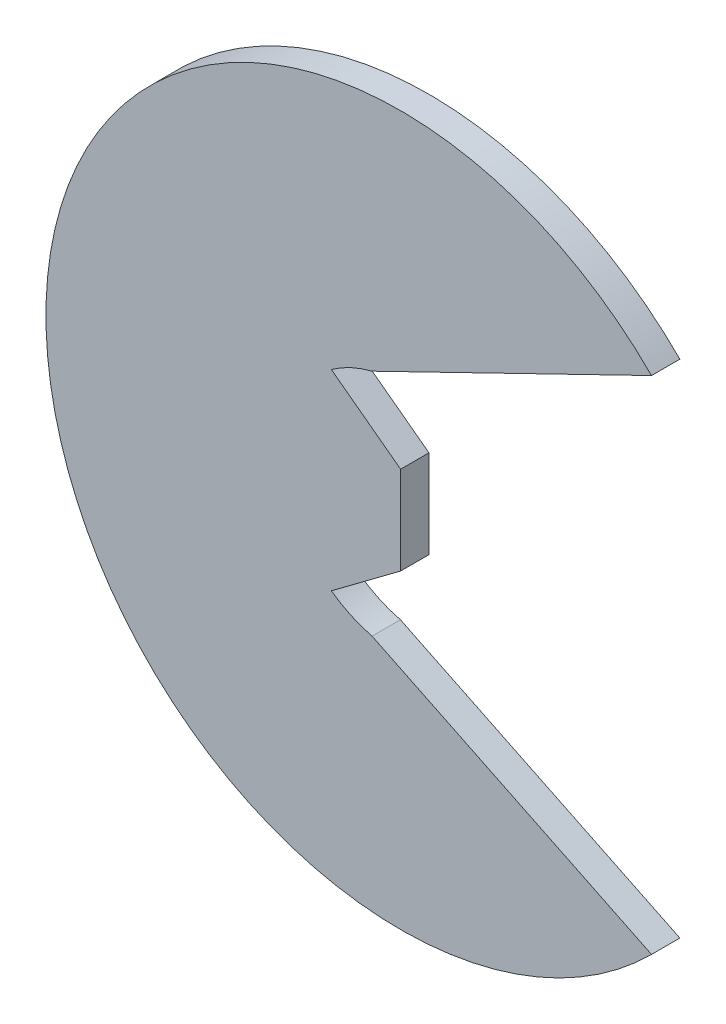
ISO-10303-21;
HEADER;
FILE_DESCRIPTION(('STEP AP214'),'2;1');
FILE_NAME('part.step','',(''),(''),'','','');
FILE_SCHEMA(('AUTOMOTIVE_DESIGN { 1 0 10303 214 1 1 1 1 }'));
ENDSEC;
DATA;
#1=APPLICATION_CONTEXT('core data for automotive mechanical design processes');
#2=APPLICATION_PROTOCOL_DEFINITION('international standard','automotive_design',2000,#1);
#3=PRODUCT_CONTEXT('',#1,'mechanical');
#4=PRODUCT('Part','Part','',(#3));
#5=PRODUCT_RELATED_PRODUCT_CATEGORY('part','',(#4));
#6=PRODUCT_DEFINITION_FORMATION('','',#4);
#7=PRODUCT_DEFINITION_CONTEXT('part definition',#1,'design');
#8=PRODUCT_DEFINITION('design','',#6,#7);
#9=PRODUCT_DEFINITION_SHAPE('','',#8);
#10=(LENGTH_UNIT() NAMED_UNIT(*) SI_UNIT(.MILLI.,.METRE.));
#11=(NAMED_UNIT(*) PLANE_ANGLE_UNIT() SI_UNIT($,.RADIAN.));
#12=(NAMED_UNIT(*) SI_UNIT($,.STERADIAN.) SOLID_ANGLE_UNIT());
#13=UNCERTAINTY_MEASURE_WITH_UNIT(LENGTH_MEASURE(1.E-05),#10,'distance_accuracy_value','');
#14=(GEOMETRIC_REPRESENTATION_CONTEXT(3) GLOBAL_UNCERTAINTY_ASSIGNED_CONTEXT((#13)) GLOBAL_UNIT_ASSIGNED_CONTEXT((#10,
#11,#12)) REPRESENTATION_CONTEXT('',''));
#15=CARTESIAN_POINT('',(0.,0.,0.));
#16=DIRECTION('',(0.,0.,1.));
#17=DIRECTION('',(1.,0.,0.));
#18=AXIS2_PLACEMENT_3D('',#15,#16,#17);
#19=CARTESIAN_POINT('',(0.,0.,0.3));
#20=DIRECTION('',(0.,0.,-1.));
#21=DIRECTION('',(-1.,0.,0.));
#22=AXIS2_PLACEMENT_3D('',#19,#20,#21);
#23=CYLINDRICAL_SURFACE('',#22,3.75);
#24=CARTESIAN_POINT('',(0.,0.,0.3));
#25=DIRECTION('',(0.,0.,1.));
#26=DIRECTION('',(1.,0.,0.));
#27=AXIS2_PLACEMENT_3D('',#24,#25,#26);
#28=CIRCLE('',#27,3.75);
#29=CARTESIAN_POINT('',(2.65301607221585,2.65028408299268,0.3));
#30=VERTEX_POINT('',#29);
#31=CARTESIAN_POINT('',(2.65301607221585,-2.65028408299268,0.3));
#32=VERTEX_POINT('',#31);
#33=EDGE_CURVE('E11',#30,#32,#28,.T.);
#34=ORIENTED_EDGE('',*,*,#33,.F.);
#35=DIRECTION('',(0.,0.,1.));
#36=VECTOR('',#35,1.);
#37=CARTESIAN_POINT('',(2.65301607221585,2.65028408299268,0.));
#38=LINE('',#37,#36);
#39=CARTESIAN_POINT('',(2.65301607221585,2.65028408299268,0.));
#40=VERTEX_POINT('',#39);
#41=EDGE_CURVE('E110',#40,#30,#38,.T.);
#42=ORIENTED_EDGE('',*,*,#41,.F.);
#43=CARTESIAN_POINT('',(0.,0.,0.));
#44=DIRECTION('',(0.,0.,1.));
#45=DIRECTION('',(1.,0.,0.));
#46=AXIS2_PLACEMENT_3D('',#43,#44,#45);
#47=CIRCLE('',#46,3.75);
#48=CARTESIAN_POINT('',(2.65301607221585,-2.65028408299268,0.));
#49=VERTEX_POINT('',#48);
#50=EDGE_CURVE('E35',#40,#49,#47,.T.);
#51=ORIENTED_EDGE('',*,*,#50,.T.);
#52=DIRECTION('',(0.,0.,1.));
#53=VECTOR('',#52,1.);
#54=CARTESIAN_POINT('',(2.65301607221585,-2.65028408299268,0.));
#55=LINE('',#54,#53);
#56=EDGE_CURVE('E100',#49,#32,#55,.T.);
#57=ORIENTED_EDGE('',*,*,#56,.T.);
#58=EDGE_LOOP('',(#34,#42,#51,#57));
#59=FACE_BOUND('',#58,.T.);
#60=ADVANCED_FACE('F32',(#59),#23,.T.);
#61=CARTESIAN_POINT('',(0.,0.,0.3));
#62=DIRECTION('',(0.,0.,1.));
#63=DIRECTION('',(1.,0.,0.));
#64=AXIS2_PLACEMENT_3D('',#61,#62,#63);
#65=PLANE('',#64);
#66=DIRECTION('',(-0.899259664218511,-0.437415198992456,0.));
#67=VECTOR('',#66,1.);
#68=CARTESIAN_POINT('',(-0.301764614195362,1.21302849002796,0.3));
#69=LINE('',#68,#67);
#70=CARTESIAN_POINT('',(-0.301764614195362,1.21302849002796,0.3));
#71=VERTEX_POINT('',#70);
#72=EDGE_CURVE('E126',#30,#71,#69,.T.);
#73=ORIENTED_EDGE('',*,*,#72,.F.);
#74=ORIENTED_EDGE('',*,*,#33,.T.);
#75=DIRECTION('',(0.899259664218511,-0.437415198992456,0.));
#76=VECTOR('',#75,1.);
#77=CARTESIAN_POINT('',(-0.301764614195362,-1.21302849002796,0.3));
#78=LINE('',#77,#76);
#79=CARTESIAN_POINT('',(-0.301764614195362,-1.21302849002796,0.3));
#80=VERTEX_POINT('',#79);
#81=EDGE_CURVE('E106',#80,#32,#78,.T.);
#82=ORIENTED_EDGE('',*,*,#81,.F.);
#83=CARTESIAN_POINT('',(0.,0.,0.3));
#84=DIRECTION('',(0.,0.,1.));
#85=DIRECTION('',(1.,0.,0.));
#86=AXIS2_PLACEMENT_3D('',#83,#84,#85);
#87=CIRCLE('',#86,1.25);
#88=CARTESIAN_POINT('',(-0.732124859719739,-1.01316000206303,0.3));
#89=VERTEX_POINT('',#88);
#90=EDGE_CURVE('E152',#89,#80,#87,.T.);
#91=ORIENTED_EDGE('',*,*,#90,.F.);
#92=DIRECTION('',(-0.801230477588185,-0.598355848792178,0.));
#93=VECTOR('',#92,1.);
#94=CARTESIAN_POINT('',(0.,-0.466411963748117,0.3));
#95=LINE('',#94,#93);
#96=CARTESIAN_POINT('',(0.,-0.466411963748117,0.3));
#97=VERTEX_POINT('',#96);
#98=EDGE_CURVE('E149',#97,#89,#95,.T.);
#99=ORIENTED_EDGE('',*,*,#98,.F.);
#100=DIRECTION('',(0.,-1.,0.));
#101=VECTOR('',#100,1.);
#102=CARTESIAN_POINT('',(0.,-0.466411963748117,0.3));
#103=LINE('',#102,#101);
#104=CARTESIAN_POINT('',(0.,0.466411963748117,0.3));
#105=VERTEX_POINT('',#104);
#106=EDGE_CURVE('E146',#105,#97,#103,.T.);
#107=ORIENTED_EDGE('',*,*,#106,.F.);
#108=DIRECTION('',(0.801230477588185,-0.598355848792179,0.));
#109=VECTOR('',#108,1.);
#110=CARTESIAN_POINT('',(0.,0.466411963748117,0.3));
#111=LINE('',#110,#109);
#112=CARTESIAN_POINT('',(-0.732124859719739,1.01316000206303,0.3));
#113=VERTEX_POINT('',#112);
#114=EDGE_CURVE('E144',#113,#105,#111,.T.);
#115=ORIENTED_EDGE('',*,*,#114,.F.);
#116=CARTESIAN_POINT('',(0.,0.,0.3));
#117=DIRECTION('',(0.,0.,1.));
#118=DIRECTION('',(1.,0.,0.));
#119=AXIS2_PLACEMENT_3D('',#116,#117,#118);
#120=CIRCLE('',#119,1.25);
#121=EDGE_CURVE('E142',#71,#113,#120,.T.);
#122=ORIENTED_EDGE('',*,*,#121,.F.);
#123=EDGE_LOOP('',(#73,#74,#82,#91,#99,#107,#115,#122));
#124=FACE_BOUND('',#123,.T.);
#125=ADVANCED_FACE('F172',(#124),#65,.T.);
#126=CARTESIAN_POINT('',(0.,0.,0.));
#127=DIRECTION('',(0.,0.,1.));
#128=DIRECTION('',(1.,0.,0.));
#129=AXIS2_PLACEMENT_3D('',#126,#127,#128);
#130=PLANE('',#129);
#131=ORIENTED_EDGE('',*,*,#50,.F.);
#132=DIRECTION('',(-0.899259664218511,-0.437415198992456,0.));
#133=VECTOR('',#132,1.);
#134=CARTESIAN_POINT('',(-0.301764614195362,1.21302849002796,0.));
#135=LINE('',#134,#133);
#136=CARTESIAN_POINT('',(-0.301764614195362,1.21302849002796,0.));
#137=VERTEX_POINT('',#136);
#138=EDGE_CURVE('E120',#40,#137,#135,.T.);
#139=ORIENTED_EDGE('',*,*,#138,.T.);
#140=CARTESIAN_POINT('',(0.,0.,0.));
#141=DIRECTION('',(0.,0.,1.));
#142=DIRECTION('',(1.,0.,0.));
#143=AXIS2_PLACEMENT_3D('',#140,#141,#142);
#144=CIRCLE('',#143,1.25);
#145=CARTESIAN_POINT('',(-0.732124859719739,1.01316000206303,0.));
#146=VERTEX_POINT('',#145);
#147=EDGE_CURVE('E154',#137,#146,#144,.T.);
#148=ORIENTED_EDGE('',*,*,#147,.T.);
#149=DIRECTION('',(0.801230477588185,-0.598355848792179,0.));
#150=VECTOR('',#149,1.);
#151=CARTESIAN_POINT('',(0.,0.466411963748117,0.));
#152=LINE('',#151,#150);
#153=CARTESIAN_POINT('',(0.,0.466411963748117,0.));
#154=VERTEX_POINT('',#153);
#155=EDGE_CURVE('E157',#146,#154,#152,.T.);
#156=ORIENTED_EDGE('',*,*,#155,.T.);
#157=DIRECTION('',(0.,-1.,0.));
#158=VECTOR('',#157,1.);
#159=CARTESIAN_POINT('',(0.,-0.466411963748117,0.));
#160=LINE('',#159,#158);
#161=CARTESIAN_POINT('',(0.,-0.466411963748117,0.));
#162=VERTEX_POINT('',#161);
#163=EDGE_CURVE('E46',#154,#162,#160,.T.);
#164=ORIENTED_EDGE('',*,*,#163,.T.);
#165=DIRECTION('',(-0.801230477588185,-0.598355848792178,0.));
#166=VECTOR('',#165,1.);
#167=CARTESIAN_POINT('',(0.,-0.466411963748117,0.));
#168=LINE('',#167,#166);
#169=CARTESIAN_POINT('',(-0.732124859719739,-1.01316000206303,0.));
#170=VERTEX_POINT('',#169);
#171=EDGE_CURVE('E163',#162,#170,#168,.T.);
#172=ORIENTED_EDGE('',*,*,#171,.T.);
#173=CARTESIAN_POINT('',(0.,0.,0.));
#174=DIRECTION('',(0.,0.,1.));
#175=DIRECTION('',(1.,0.,0.));
#176=AXIS2_PLACEMENT_3D('',#173,#174,#175);
#177=CIRCLE('',#176,1.25);
#178=CARTESIAN_POINT('',(-0.301764614195362,-1.21302849002796,0.));
#179=VERTEX_POINT('',#178);
#180=EDGE_CURVE('E119',#170,#179,#177,.T.);
#181=ORIENTED_EDGE('',*,*,#180,.T.);
#182=DIRECTION('',(0.899259664218511,-0.437415198992456,0.));
#183=VECTOR('',#182,1.);
#184=CARTESIAN_POINT('',(-0.301764614195362,-1.21302849002796,0.));
#185=LINE('',#184,#183);
#186=EDGE_CURVE('E103',#179,#49,#185,.T.);
#187=ORIENTED_EDGE('',*,*,#186,.T.);
#188=EDGE_LOOP('',(#131,#139,#148,#156,#164,#172,#181,#187));
#189=FACE_BOUND('',#188,.T.);
#190=ADVANCED_FACE('F115',(#189),#130,.F.);
#191=CARTESIAN_POINT('',(0.,0.,0.));
#192=DIRECTION('',(0.,0.,1.));
#193=DIRECTION('',(1.,0.,0.));
#194=AXIS2_PLACEMENT_3D('',#191,#192,#193);
#195=CYLINDRICAL_SURFACE('',#194,1.25);
#196=ORIENTED_EDGE('',*,*,#121,.T.);
#197=DIRECTION('',(0.,0.,1.));
#198=VECTOR('',#197,1.);
#199=CARTESIAN_POINT('',(-0.732124859719739,1.01316000206303,0.));
#200=LINE('',#199,#198);
#201=EDGE_CURVE('E87',#146,#113,#200,.T.);
#202=ORIENTED_EDGE('',*,*,#201,.F.);
#203=ORIENTED_EDGE('',*,*,#147,.F.);
#204=DIRECTION('',(0.,0.,1.));
#205=VECTOR('',#204,1.);
#206=CARTESIAN_POINT('',(-0.301764614195362,1.21302849002796,0.));
#207=LINE('',#206,#205);
#208=EDGE_CURVE('E55',#137,#71,#207,.T.);
#209=ORIENTED_EDGE('',*,*,#208,.T.);
#210=EDGE_LOOP('',(#196,#202,#203,#209));
#211=FACE_BOUND('',#210,.T.);
#212=ADVANCED_FACE('F175',(#211),#195,.F.);
#213=CARTESIAN_POINT('',(-0.301764614195362,1.21302849002796,0.));
#214=DIRECTION('',(-0.437415198992456,0.899259664218511,0.));
#215=DIRECTION('',(-0.899259664218511,-0.437415198992456,0.));
#216=AXIS2_PLACEMENT_3D('',#213,#214,#215);
#217=PLANE('',#216);
#218=ORIENTED_EDGE('',*,*,#72,.T.);
#219=ORIENTED_EDGE('',*,*,#208,.F.);
#220=ORIENTED_EDGE('',*,*,#138,.F.);
#221=ORIENTED_EDGE('',*,*,#41,.T.);
#222=EDGE_LOOP('',(#218,#219,#220,#221));
#223=FACE_BOUND('',#222,.T.);
#224=ADVANCED_FACE('F177',(#223),#217,.F.);
#225=CARTESIAN_POINT('',(-0.301764614195362,-1.21302849002796,0.));
#226=DIRECTION('',(-0.437415198992456,-0.899259664218511,0.));
#227=DIRECTION('',(0.899259664218511,-0.437415198992456,0.));
#228=AXIS2_PLACEMENT_3D('',#225,#226,#227);
#229=PLANE('',#228);
#230=ORIENTED_EDGE('',*,*,#81,.T.);
#231=ORIENTED_EDGE('',*,*,#56,.F.);
#232=ORIENTED_EDGE('',*,*,#186,.F.);
#233=DIRECTION('',(0.,0.,1.));
#234=VECTOR('',#233,1.);
#235=CARTESIAN_POINT('',(-0.301764614195362,-1.21302849002796,0.));
#236=LINE('',#235,#234);
#237=EDGE_CURVE('E111',#179,#80,#236,.T.);
#238=ORIENTED_EDGE('',*,*,#237,.T.);
#239=EDGE_LOOP('',(#230,#231,#232,#238));
#240=FACE_BOUND('',#239,.T.);
#241=ADVANCED_FACE('F102',(#240),#229,.F.);
#242=CARTESIAN_POINT('',(0.,0.,0.));
#243=DIRECTION('',(0.,0.,1.));
#244=DIRECTION('',(1.,0.,0.));
#245=AXIS2_PLACEMENT_3D('',#242,#243,#244);
#246=CYLINDRICAL_SURFACE('',#245,1.25);
#247=ORIENTED_EDGE('',*,*,#90,.T.);
#248=ORIENTED_EDGE('',*,*,#237,.F.);
#249=ORIENTED_EDGE('',*,*,#180,.F.);
#250=DIRECTION('',(0.,0.,1.));
#251=VECTOR('',#250,1.);
#252=CARTESIAN_POINT('',(-0.732124859719739,-1.01316000206303,0.));
#253=LINE('',#252,#251);
#254=EDGE_CURVE('E130',#170,#89,#253,.T.);
#255=ORIENTED_EDGE('',*,*,#254,.T.);
#256=EDGE_LOOP('',(#247,#248,#249,#255));
#257=FACE_BOUND('',#256,.T.);
#258=ADVANCED_FACE('F170',(#257),#246,.F.);
#259=CARTESIAN_POINT('',(0.,-0.466411963748117,0.));
#260=DIRECTION('',(-0.598355848792178,0.801230477588186,0.));
#261=DIRECTION('',(-0.801230477588186,-0.598355848792178,0.));
#262=AXIS2_PLACEMENT_3D('',#259,#260,#261);
#263=PLANE('',#262);
#264=ORIENTED_EDGE('',*,*,#98,.T.);
#265=ORIENTED_EDGE('',*,*,#254,.F.);
#266=ORIENTED_EDGE('',*,*,#171,.F.);
#267=DIRECTION('',(0.,0.,1.));
#268=VECTOR('',#267,1.);
#269=CARTESIAN_POINT('',(0.,-0.466411963748117,0.));
#270=LINE('',#269,#268);
#271=EDGE_CURVE('E132',#162,#97,#270,.T.);
#272=ORIENTED_EDGE('',*,*,#271,.T.);
#273=EDGE_LOOP('',(#264,#265,#266,#272));
#274=FACE_BOUND('',#273,.T.);
#275=ADVANCED_FACE('F166',(#274),#263,.F.);
#276=CARTESIAN_POINT('',(0.,-0.466411963748117,0.));
#277=DIRECTION('',(-1.,0.,0.));
#278=DIRECTION('',(0.,0.,1.));
#279=AXIS2_PLACEMENT_3D('',#276,#277,#278);
#280=PLANE('',#279);
#281=ORIENTED_EDGE('',*,*,#106,.T.);
#282=ORIENTED_EDGE('',*,*,#271,.F.);
#283=ORIENTED_EDGE('',*,*,#163,.F.);
#284=DIRECTION('',(0.,0.,1.));
#285=VECTOR('',#284,1.);
#286=CARTESIAN_POINT('',(0.,0.466411963748117,0.));
#287=LINE('',#286,#285);
#288=EDGE_CURVE('E134',#154,#105,#287,.T.);
#289=ORIENTED_EDGE('',*,*,#288,.T.);
#290=EDGE_LOOP('',(#281,#282,#283,#289));
#291=FACE_BOUND('',#290,.T.);
#292=ADVANCED_FACE('F231',(#291),#280,.F.);
#293=CARTESIAN_POINT('',(0.,0.466411963748117,0.));
#294=DIRECTION('',(-0.598355848792179,-0.801230477588185,0.));
#295=DIRECTION('',(0.801230477588185,-0.598355848792179,0.));
#296=AXIS2_PLACEMENT_3D('',#293,#294,#295);
#297=PLANE('',#296);
#298=ORIENTED_EDGE('',*,*,#114,.T.);
#299=ORIENTED_EDGE('',*,*,#288,.F.);
#300=ORIENTED_EDGE('',*,*,#155,.F.);
#301=ORIENTED_EDGE('',*,*,#201,.T.);
#302=EDGE_LOOP('',(#298,#299,#300,#301));
#303=FACE_BOUND('',#302,.T.);
#304=ADVANCED_FACE('F240',(#303),#297,.F.);
#305=CLOSED_SHELL('',(#60,#125,#190,#212,#224,#241,#258,#275,#292,#304));
#306=MANIFOLD_SOLID_BREP('B2',#305);
#307=ADVANCED_BREP_SHAPE_REPRESENTATION('',(#18,#306),#14);
#308=SHAPE_DEFINITION_REPRESENTATION(#9,#307);
ENDSEC;
END-ISO-10303-21;
